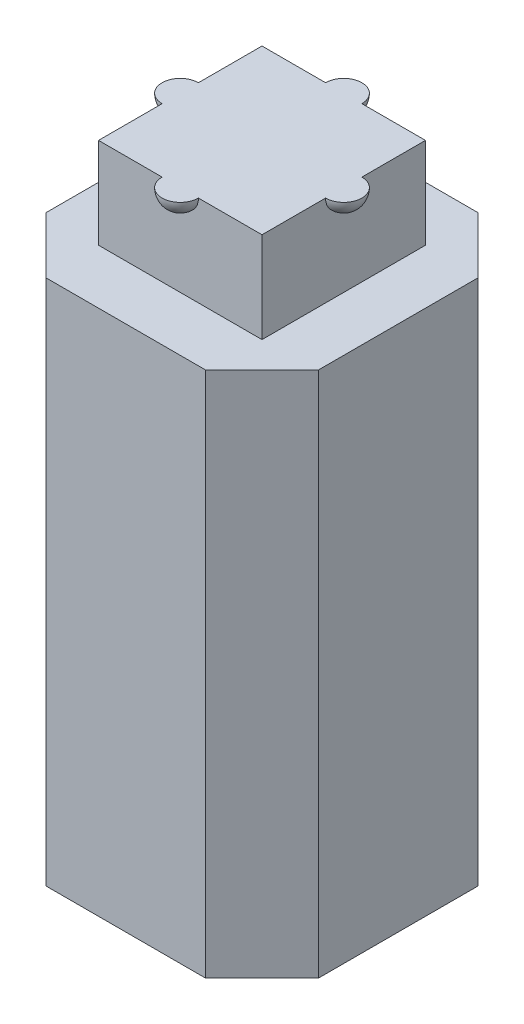
ISO-10303-21;
HEADER;
FILE_DESCRIPTION(('STEP AP214'),'2;1');
FILE_NAME('part.step','',(''),(''),'','','');
FILE_SCHEMA(('AUTOMOTIVE_DESIGN { 1 0 10303 214 1 1 1 1 }'));
ENDSEC;
DATA;
#1=APPLICATION_CONTEXT('core data for automotive mechanical design processes');
#2=APPLICATION_PROTOCOL_DEFINITION('international standard','automotive_design',2000,#1);
#3=PRODUCT_CONTEXT('',#1,'mechanical');
#4=PRODUCT('Part','Part','',(#3));
#5=PRODUCT_RELATED_PRODUCT_CATEGORY('part','',(#4));
#6=PRODUCT_DEFINITION_FORMATION('','',#4);
#7=PRODUCT_DEFINITION_CONTEXT('part definition',#1,'design');
#8=PRODUCT_DEFINITION('design','',#6,#7);
#9=PRODUCT_DEFINITION_SHAPE('','',#8);
#10=(LENGTH_UNIT() NAMED_UNIT(*) SI_UNIT(.MILLI.,.METRE.));
#11=(NAMED_UNIT(*) PLANE_ANGLE_UNIT() SI_UNIT($,.RADIAN.));
#12=(NAMED_UNIT(*) SI_UNIT($,.STERADIAN.) SOLID_ANGLE_UNIT());
#13=UNCERTAINTY_MEASURE_WITH_UNIT(LENGTH_MEASURE(1.E-05),#10,'distance_accuracy_value','');
#14=(GEOMETRIC_REPRESENTATION_CONTEXT(3) GLOBAL_UNCERTAINTY_ASSIGNED_CONTEXT((#13)) GLOBAL_UNIT_ASSIGNED_CONTEXT((#10,
#11,#12)) REPRESENTATION_CONTEXT('',''));
#15=CARTESIAN_POINT('',(0.,0.,0.));
#16=DIRECTION('',(0.,0.,1.));
#17=DIRECTION('',(1.,0.,0.));
#18=AXIS2_PLACEMENT_3D('',#15,#16,#17);
#19=CARTESIAN_POINT('',(0.,17.,2.25));
#20=DIRECTION('',(0.,0.,-1.));
#21=DIRECTION('',(1.,0.,0.));
#22=AXIS2_PLACEMENT_3D('',#19,#20,#21);
#23=SPHERICAL_SURFACE('',#22,0.5);
#24=CARTESIAN_POINT('',(0.,17.,2.25));
#25=DIRECTION('',(0.,0.,-1.));
#26=DIRECTION('',(-1.,0.,0.));
#27=AXIS2_PLACEMENT_3D('',#24,#25,#26);
#28=CIRCLE('',#27,0.5);
#29=CARTESIAN_POINT('',(0.5,17.,2.25));
#30=VERTEX_POINT('',#29);
#31=CARTESIAN_POINT('',(-0.5,17.,2.25));
#32=VERTEX_POINT('',#31);
#33=EDGE_CURVE('E242',#30,#32,#28,.T.);
#34=ORIENTED_EDGE('',*,*,#33,.F.);
#35=CARTESIAN_POINT('',(0.,17.,2.25));
#36=DIRECTION('',(0.,1.,0.));
#37=DIRECTION('',(0.,0.,1.));
#38=AXIS2_PLACEMENT_3D('',#35,#36,#37);
#39=CIRCLE('',#38,0.5);
#40=EDGE_CURVE('E236',#30,#32,#39,.F.);
#41=ORIENTED_EDGE('',*,*,#40,.T.);
#42=EDGE_LOOP('',(#34,#41));
#43=FACE_BOUND('',#42,.T.);
#44=ADVANCED_FACE('F34',(#43),#23,.T.);
#45=CARTESIAN_POINT('',(0.,17.,-2.25));
#46=DIRECTION('',(0.,0.,-1.));
#47=DIRECTION('',(1.,0.,0.));
#48=AXIS2_PLACEMENT_3D('',#45,#46,#47);
#49=SPHERICAL_SURFACE('',#48,0.5);
#50=CARTESIAN_POINT('',(0.,17.,-2.25));
#51=DIRECTION('',(0.,0.,1.));
#52=DIRECTION('',(1.,0.,0.));
#53=AXIS2_PLACEMENT_3D('',#50,#51,#52);
#54=CIRCLE('',#53,0.5);
#55=CARTESIAN_POINT('',(-0.5,17.,-2.25));
#56=VERTEX_POINT('',#55);
#57=CARTESIAN_POINT('',(0.5,17.,-2.25));
#58=VERTEX_POINT('',#57);
#59=EDGE_CURVE('E234',#56,#58,#54,.T.);
#60=ORIENTED_EDGE('',*,*,#59,.F.);
#61=CARTESIAN_POINT('',(0.,17.,-2.25));
#62=DIRECTION('',(0.,1.,0.));
#63=DIRECTION('',(0.,0.,1.));
#64=AXIS2_PLACEMENT_3D('',#61,#62,#63);
#65=CIRCLE('',#64,0.5);
#66=EDGE_CURVE('E54',#56,#58,#65,.F.);
#67=ORIENTED_EDGE('',*,*,#66,.T.);
#68=EDGE_LOOP('',(#60,#67));
#69=FACE_BOUND('',#68,.T.);
#70=ADVANCED_FACE('F482',(#69),#49,.T.);
#71=CARTESIAN_POINT('',(2.25,17.,0.));
#72=DIRECTION('',(-1.,0.,0.));
#73=DIRECTION('',(0.,0.,1.));
#74=AXIS2_PLACEMENT_3D('',#71,#72,#73);
#75=SPHERICAL_SURFACE('',#74,0.5);
#76=CARTESIAN_POINT('',(2.25,17.,0.));
#77=DIRECTION('',(-1.,0.,0.));
#78=DIRECTION('',(0.,0.,1.));
#79=AXIS2_PLACEMENT_3D('',#76,#77,#78);
#80=CIRCLE('',#79,0.5);
#81=CARTESIAN_POINT('',(2.25,17.,-0.5));
#82=VERTEX_POINT('',#81);
#83=CARTESIAN_POINT('',(2.25,17.,0.5));
#84=VERTEX_POINT('',#83);
#85=EDGE_CURVE('E230',#82,#84,#80,.T.);
#86=ORIENTED_EDGE('',*,*,#85,.F.);
#87=CARTESIAN_POINT('',(2.25,17.,0.));
#88=DIRECTION('',(0.,1.,0.));
#89=DIRECTION('',(0.,0.,1.));
#90=AXIS2_PLACEMENT_3D('',#87,#88,#89);
#91=CIRCLE('',#90,0.5);
#92=EDGE_CURVE('E231',#82,#84,#91,.F.);
#93=ORIENTED_EDGE('',*,*,#92,.T.);
#94=EDGE_LOOP('',(#86,#93));
#95=FACE_BOUND('',#94,.T.);
#96=ADVANCED_FACE('F488',(#95),#75,.T.);
#97=CARTESIAN_POINT('',(-2.25,17.,0.));
#98=DIRECTION('',(-1.,0.,0.));
#99=DIRECTION('',(0.,0.,1.));
#100=AXIS2_PLACEMENT_3D('',#97,#98,#99);
#101=SPHERICAL_SURFACE('',#100,0.5);
#102=CARTESIAN_POINT('',(-2.25,17.,0.));
#103=DIRECTION('',(1.,0.,0.));
#104=DIRECTION('',(0.,0.,-1.));
#105=AXIS2_PLACEMENT_3D('',#102,#103,#104);
#106=CIRCLE('',#105,0.5);
#107=CARTESIAN_POINT('',(-2.25,17.,0.5));
#108=VERTEX_POINT('',#107);
#109=CARTESIAN_POINT('',(-2.25,17.,-0.5));
#110=VERTEX_POINT('',#109);
#111=EDGE_CURVE('E217',#108,#110,#106,.T.);
#112=ORIENTED_EDGE('',*,*,#111,.F.);
#113=CARTESIAN_POINT('',(-2.25,17.,0.));
#114=DIRECTION('',(0.,1.,0.));
#115=DIRECTION('',(0.,0.,1.));
#116=AXIS2_PLACEMENT_3D('',#113,#114,#115);
#117=CIRCLE('',#116,0.5);
#118=EDGE_CURVE('E11',#108,#110,#117,.F.);
#119=ORIENTED_EDGE('',*,*,#118,.T.);
#120=EDGE_LOOP('',(#112,#119));
#121=FACE_BOUND('',#120,.T.);
#122=ADVANCED_FACE('F215',(#121),#101,.T.);
#123=CARTESIAN_POINT('',(0.,14.5,0.));
#124=DIRECTION('',(0.,1.,0.));
#125=DIRECTION('',(0.,0.,1.));
#126=AXIS2_PLACEMENT_3D('',#123,#124,#125);
#127=PLANE('',#126);
#128=DIRECTION('',(0.707106781186547,0.,0.707106781186547));
#129=VECTOR('',#128,1.);
#130=CARTESIAN_POINT('',(-3.75,14.5,2.18969696196701));
#131=LINE('',#130,#129);
#132=CARTESIAN_POINT('',(-3.75,14.5,2.18969696196701));
#133=VERTEX_POINT('',#132);
#134=CARTESIAN_POINT('',(-2.18969696196701,14.5,3.75));
#135=VERTEX_POINT('',#134);
#136=EDGE_CURVE('E273',#133,#135,#131,.T.);
#137=ORIENTED_EDGE('',*,*,#136,.T.);
#138=DIRECTION('',(1.,0.,0.));
#139=VECTOR('',#138,1.);
#140=CARTESIAN_POINT('',(-2.18969696196701,14.5,3.75));
#141=LINE('',#140,#139);
#142=CARTESIAN_POINT('',(2.189696961967,14.5,3.75));
#143=VERTEX_POINT('',#142);
#144=EDGE_CURVE('E276',#135,#143,#141,.T.);
#145=ORIENTED_EDGE('',*,*,#144,.T.);
#146=DIRECTION('',(0.707106781186548,0.,-0.707106781186547));
#147=VECTOR('',#146,1.);
#148=CARTESIAN_POINT('',(2.189696961967,14.5,3.75));
#149=LINE('',#148,#147);
#150=CARTESIAN_POINT('',(3.75,14.5,2.189696961967));
#151=VERTEX_POINT('',#150);
#152=EDGE_CURVE('E279',#143,#151,#149,.T.);
#153=ORIENTED_EDGE('',*,*,#152,.T.);
#154=DIRECTION('',(0.,0.,-1.));
#155=VECTOR('',#154,1.);
#156=CARTESIAN_POINT('',(3.75,14.5,2.189696961967));
#157=LINE('',#156,#155);
#158=CARTESIAN_POINT('',(3.75,14.5,-2.18969696196701));
#159=VERTEX_POINT('',#158);
#160=EDGE_CURVE('E282',#151,#159,#157,.T.);
#161=ORIENTED_EDGE('',*,*,#160,.T.);
#162=DIRECTION('',(-0.707106781186552,0.,-0.707106781186544));
#163=VECTOR('',#162,1.);
#164=CARTESIAN_POINT('',(3.75,14.5,-2.18969696196701));
#165=LINE('',#164,#163);
#166=CARTESIAN_POINT('',(2.18969696196699,14.5,-3.75));
#167=VERTEX_POINT('',#166);
#168=EDGE_CURVE('E285',#159,#167,#165,.T.);
#169=ORIENTED_EDGE('',*,*,#168,.T.);
#170=DIRECTION('',(-1.,0.,0.));
#171=VECTOR('',#170,1.);
#172=CARTESIAN_POINT('',(2.18969696196699,14.5,-3.75));
#173=LINE('',#172,#171);
#174=CARTESIAN_POINT('',(-2.189696961967,14.5,-3.75));
#175=VERTEX_POINT('',#174);
#176=EDGE_CURVE('E288',#167,#175,#173,.T.);
#177=ORIENTED_EDGE('',*,*,#176,.T.);
#178=DIRECTION('',(-0.707106781186547,0.,0.707106781186547));
#179=VECTOR('',#178,1.);
#180=CARTESIAN_POINT('',(-2.189696961967,14.5,-3.75));
#181=LINE('',#180,#179);
#182=CARTESIAN_POINT('',(-3.75,14.5,-2.189696961967));
#183=VERTEX_POINT('',#182);
#184=EDGE_CURVE('E291',#175,#183,#181,.T.);
#185=ORIENTED_EDGE('',*,*,#184,.T.);
#186=DIRECTION('',(0.,0.,1.));
#187=VECTOR('',#186,1.);
#188=CARTESIAN_POINT('',(-3.75,14.5,-2.189696961967));
#189=LINE('',#188,#187);
#190=EDGE_CURVE('E294',#183,#133,#189,.T.);
#191=ORIENTED_EDGE('',*,*,#190,.T.);
#192=EDGE_LOOP('',(#137,#145,#153,#161,#169,#177,#185,#191));
#193=FACE_BOUND('',#192,.T.);
#194=DIRECTION('',(-1.,0.,0.));
#195=VECTOR('',#194,1.);
#196=CARTESIAN_POINT('',(-2.25,14.5,-2.25));
#197=LINE('',#196,#195);
#198=CARTESIAN_POINT('',(2.25,14.5,-2.25));
#199=VERTEX_POINT('',#198);
#200=CARTESIAN_POINT('',(-2.25,14.5,-2.25));
#201=VERTEX_POINT('',#200);
#202=EDGE_CURVE('E258',#199,#201,#197,.T.);
#203=ORIENTED_EDGE('',*,*,#202,.F.);
#204=DIRECTION('',(0.,0.,-1.));
#205=VECTOR('',#204,1.);
#206=CARTESIAN_POINT('',(2.25,14.5,-2.25));
#207=LINE('',#206,#205);
#208=CARTESIAN_POINT('',(2.25,14.5,2.25));
#209=VERTEX_POINT('',#208);
#210=EDGE_CURVE('E245',#209,#199,#207,.T.);
#211=ORIENTED_EDGE('',*,*,#210,.F.);
#212=DIRECTION('',(1.,0.,0.));
#213=VECTOR('',#212,1.);
#214=CARTESIAN_POINT('',(-2.25,14.5,2.25));
#215=LINE('',#214,#213);
#216=CARTESIAN_POINT('',(-2.25,14.5,2.25));
#217=VERTEX_POINT('',#216);
#218=EDGE_CURVE('E263',#217,#209,#215,.T.);
#219=ORIENTED_EDGE('',*,*,#218,.F.);
#220=DIRECTION('',(0.,0.,1.));
#221=VECTOR('',#220,1.);
#222=CARTESIAN_POINT('',(-2.25,14.5,-2.25));
#223=LINE('',#222,#221);
#224=EDGE_CURVE('E260',#201,#217,#223,.T.);
#225=ORIENTED_EDGE('',*,*,#224,.F.);
#226=EDGE_LOOP('',(#203,#211,#219,#225));
#227=FACE_BOUND('',#226,.T.);
#228=ADVANCED_FACE('F455',(#193,#227),#127,.T.);
#229=CARTESIAN_POINT('',(0.,0.,0.));
#230=DIRECTION('',(0.,1.,0.));
#231=DIRECTION('',(0.,0.,1.));
#232=AXIS2_PLACEMENT_3D('',#229,#230,#231);
#233=PLANE('',#232);
#234=DIRECTION('',(1.,0.,0.));
#235=VECTOR('',#234,1.);
#236=CARTESIAN_POINT('',(2.189696961967,0.,3.75));
#237=LINE('',#236,#235);
#238=CARTESIAN_POINT('',(-2.18969696196701,0.,3.75));
#239=VERTEX_POINT('',#238);
#240=CARTESIAN_POINT('',(2.189696961967,0.,3.75));
#241=VERTEX_POINT('',#240);
#242=EDGE_CURVE('E395',#239,#241,#237,.T.);
#243=ORIENTED_EDGE('',*,*,#242,.F.);
#244=DIRECTION('',(0.707106781186547,0.,0.707106781186547));
#245=VECTOR('',#244,1.);
#246=CARTESIAN_POINT('',(-3.75,0.,2.18969696196701));
#247=LINE('',#246,#245);
#248=CARTESIAN_POINT('',(-3.75,0.,2.18969696196701));
#249=VERTEX_POINT('',#248);
#250=EDGE_CURVE('E410',#249,#239,#247,.T.);
#251=ORIENTED_EDGE('',*,*,#250,.F.);
#252=DIRECTION('',(0.,0.,1.));
#253=VECTOR('',#252,1.);
#254=CARTESIAN_POINT('',(-3.75,0.,-2.189696961967));
#255=LINE('',#254,#253);
#256=CARTESIAN_POINT('',(-3.75,0.,-2.189696961967));
#257=VERTEX_POINT('',#256);
#258=EDGE_CURVE('E408',#257,#249,#255,.T.);
#259=ORIENTED_EDGE('',*,*,#258,.F.);
#260=DIRECTION('',(-0.707106781186547,0.,0.707106781186547));
#261=VECTOR('',#260,1.);
#262=CARTESIAN_POINT('',(-3.75,0.,-2.189696961967));
#263=LINE('',#262,#261);
#264=CARTESIAN_POINT('',(-2.189696961967,0.,-3.75));
#265=VERTEX_POINT('',#264);
#266=EDGE_CURVE('E406',#265,#257,#263,.T.);
#267=ORIENTED_EDGE('',*,*,#266,.F.);
#268=DIRECTION('',(-1.,0.,0.));
#269=VECTOR('',#268,1.);
#270=CARTESIAN_POINT('',(2.18969696196699,0.,-3.75));
#271=LINE('',#270,#269);
#272=CARTESIAN_POINT('',(2.18969696196699,0.,-3.75));
#273=VERTEX_POINT('',#272);
#274=EDGE_CURVE('E404',#273,#265,#271,.T.);
#275=ORIENTED_EDGE('',*,*,#274,.F.);
#276=DIRECTION('',(-0.707106781186552,0.,-0.707106781186544));
#277=VECTOR('',#276,1.);
#278=CARTESIAN_POINT('',(2.18969696196699,0.,-3.75));
#279=LINE('',#278,#277);
#280=CARTESIAN_POINT('',(3.75,0.,-2.18969696196701));
#281=VERTEX_POINT('',#280);
#282=EDGE_CURVE('E402',#281,#273,#279,.T.);
#283=ORIENTED_EDGE('',*,*,#282,.F.);
#284=DIRECTION('',(0.,0.,-1.));
#285=VECTOR('',#284,1.);
#286=CARTESIAN_POINT('',(3.75,0.,-2.18969696196701));
#287=LINE('',#286,#285);
#288=CARTESIAN_POINT('',(3.75,0.,2.189696961967));
#289=VERTEX_POINT('',#288);
#290=EDGE_CURVE('E400',#289,#281,#287,.T.);
#291=ORIENTED_EDGE('',*,*,#290,.F.);
#292=DIRECTION('',(0.707106781186548,0.,-0.707106781186547));
#293=VECTOR('',#292,1.);
#294=CARTESIAN_POINT('',(2.189696961967,0.,3.75));
#295=LINE('',#294,#293);
#296=EDGE_CURVE('E398',#241,#289,#295,.T.);
#297=ORIENTED_EDGE('',*,*,#296,.F.);
#298=EDGE_LOOP('',(#243,#251,#259,#267,#275,#283,#291,#297));
#299=FACE_BOUND('',#298,.T.);
#300=DIRECTION('',(1.,0.,0.));
#301=VECTOR('',#300,1.);
#302=CARTESIAN_POINT('',(0.4,0.,2.25));
#303=LINE('',#302,#301);
#304=CARTESIAN_POINT('',(0.4,0.,2.25));
#305=VERTEX_POINT('',#304);
#306=CARTESIAN_POINT('',(2.25,0.,2.25));
#307=VERTEX_POINT('',#306);
#308=EDGE_CURVE('E297',#305,#307,#303,.T.);
#309=ORIENTED_EDGE('',*,*,#308,.T.);
#310=DIRECTION('',(0.,0.,-1.));
#311=VECTOR('',#310,1.);
#312=CARTESIAN_POINT('',(2.25,0.,0.4));
#313=LINE('',#312,#311);
#314=CARTESIAN_POINT('',(2.25,0.,0.4));
#315=VERTEX_POINT('',#314);
#316=EDGE_CURVE('E338',#307,#315,#313,.T.);
#317=ORIENTED_EDGE('',*,*,#316,.T.);
#318=CARTESIAN_POINT('',(2.25,0.,0.));
#319=DIRECTION('',(0.,1.,0.));
#320=DIRECTION('',(0.,0.,1.));
#321=AXIS2_PLACEMENT_3D('',#318,#319,#320);
#322=CIRCLE('',#321,0.4);
#323=CARTESIAN_POINT('',(2.25,0.,-0.400000000000001));
#324=VERTEX_POINT('',#323);
#325=EDGE_CURVE('E341',#315,#324,#322,.T.);
#326=ORIENTED_EDGE('',*,*,#325,.T.);
#327=DIRECTION('',(0.,0.,-1.));
#328=VECTOR('',#327,1.);
#329=CARTESIAN_POINT('',(2.25,0.,-2.25));
#330=LINE('',#329,#328);
#331=CARTESIAN_POINT('',(2.25,0.,-2.25));
#332=VERTEX_POINT('',#331);
#333=EDGE_CURVE('E344',#324,#332,#330,.T.);
#334=ORIENTED_EDGE('',*,*,#333,.T.);
#335=DIRECTION('',(-1.,0.,0.));
#336=VECTOR('',#335,1.);
#337=CARTESIAN_POINT('',(0.4,0.,-2.25));
#338=LINE('',#337,#336);
#339=CARTESIAN_POINT('',(0.4,0.,-2.25));
#340=VERTEX_POINT('',#339);
#341=EDGE_CURVE('E347',#332,#340,#338,.T.);
#342=ORIENTED_EDGE('',*,*,#341,.T.);
#343=CARTESIAN_POINT('',(0.,0.,-2.25));
#344=DIRECTION('',(0.,1.,0.));
#345=DIRECTION('',(0.,0.,1.));
#346=AXIS2_PLACEMENT_3D('',#343,#344,#345);
#347=CIRCLE('',#346,0.4);
#348=CARTESIAN_POINT('',(-0.400000000000001,0.,-2.25));
#349=VERTEX_POINT('',#348);
#350=EDGE_CURVE('E350',#340,#349,#347,.T.);
#351=ORIENTED_EDGE('',*,*,#350,.T.);
#352=DIRECTION('',(-1.,0.,0.));
#353=VECTOR('',#352,1.);
#354=CARTESIAN_POINT('',(-2.25,0.,-2.25));
#355=LINE('',#354,#353);
#356=CARTESIAN_POINT('',(-2.25,0.,-2.25));
#357=VERTEX_POINT('',#356);
#358=EDGE_CURVE('E353',#349,#357,#355,.T.);
#359=ORIENTED_EDGE('',*,*,#358,.T.);
#360=DIRECTION('',(0.,0.,1.));
#361=VECTOR('',#360,1.);
#362=CARTESIAN_POINT('',(-2.25,0.,-2.25));
#363=LINE('',#362,#361);
#364=CARTESIAN_POINT('',(-2.25,0.,-0.4));
#365=VERTEX_POINT('',#364);
#366=EDGE_CURVE('E356',#357,#365,#363,.T.);
#367=ORIENTED_EDGE('',*,*,#366,.T.);
#368=CARTESIAN_POINT('',(-2.25,0.,0.));
#369=DIRECTION('',(0.,1.,0.));
#370=DIRECTION('',(0.,0.,1.));
#371=AXIS2_PLACEMENT_3D('',#368,#369,#370);
#372=CIRCLE('',#371,0.4);
#373=CARTESIAN_POINT('',(-2.25,0.,0.4));
#374=VERTEX_POINT('',#373);
#375=EDGE_CURVE('E359',#365,#374,#372,.T.);
#376=ORIENTED_EDGE('',*,*,#375,.T.);
#377=DIRECTION('',(0.,0.,1.));
#378=VECTOR('',#377,1.);
#379=CARTESIAN_POINT('',(-2.25,0.,0.4));
#380=LINE('',#379,#378);
#381=CARTESIAN_POINT('',(-2.25,0.,2.25));
#382=VERTEX_POINT('',#381);
#383=EDGE_CURVE('E362',#374,#382,#380,.T.);
#384=ORIENTED_EDGE('',*,*,#383,.T.);
#385=DIRECTION('',(1.,0.,0.));
#386=VECTOR('',#385,1.);
#387=CARTESIAN_POINT('',(-2.25,0.,2.25));
#388=LINE('',#387,#386);
#389=CARTESIAN_POINT('',(-0.400000000000001,0.,2.25));
#390=VERTEX_POINT('',#389);
#391=EDGE_CURVE('E365',#382,#390,#388,.T.);
#392=ORIENTED_EDGE('',*,*,#391,.T.);
#393=CARTESIAN_POINT('',(0.,0.,2.25));
#394=DIRECTION('',(0.,1.,0.));
#395=DIRECTION('',(0.,0.,1.));
#396=AXIS2_PLACEMENT_3D('',#393,#394,#395);
#397=CIRCLE('',#396,0.4);
#398=EDGE_CURVE('E302',#390,#305,#397,.T.);
#399=ORIENTED_EDGE('',*,*,#398,.T.);
#400=EDGE_LOOP('',(#309,#317,#326,#334,#342,#351,#359,#367,#376,#384,#392,#399));
#401=FACE_BOUND('',#400,.T.);
#402=ADVANCED_FACE('F441',(#299,#401),#233,.F.);
#403=CARTESIAN_POINT('',(2.189696961967,4.,3.75));
#404=DIRECTION('',(0.,0.,-1.));
#405=DIRECTION('',(-1.,0.,0.));
#406=AXIS2_PLACEMENT_3D('',#403,#404,#405);
#407=PLANE('',#406);
#408=ORIENTED_EDGE('',*,*,#242,.T.);
#409=DIRECTION('',(0.,-1.,0.));
#410=VECTOR('',#409,1.);
#411=CARTESIAN_POINT('',(2.189696961967,4.,3.75));
#412=LINE('',#411,#410);
#413=EDGE_CURVE('E42',#143,#241,#412,.T.);
#414=ORIENTED_EDGE('',*,*,#413,.F.);
#415=ORIENTED_EDGE('',*,*,#144,.F.);
#416=DIRECTION('',(0.,-1.,0.));
#417=VECTOR('',#416,1.);
#418=CARTESIAN_POINT('',(-2.18969696196701,4.,3.75));
#419=LINE('',#418,#417);
#420=EDGE_CURVE('E412',#135,#239,#419,.T.);
#421=ORIENTED_EDGE('',*,*,#420,.T.);
#422=EDGE_LOOP('',(#408,#414,#415,#421));
#423=FACE_BOUND('',#422,.T.);
#424=ADVANCED_FACE('F36',(#423),#407,.F.);
#425=CARTESIAN_POINT('',(2.189696961967,4.,3.75));
#426=DIRECTION('',(-0.707106781186547,0.,-0.707106781186548));
#427=DIRECTION('',(-0.707106781186548,0.,0.707106781186547));
#428=AXIS2_PLACEMENT_3D('',#425,#426,#427);
#429=PLANE('',#428);
#430=ORIENTED_EDGE('',*,*,#296,.T.);
#431=DIRECTION('',(0.,-1.,0.));
#432=VECTOR('',#431,1.);
#433=CARTESIAN_POINT('',(3.75,4.,2.189696961967));
#434=LINE('',#433,#432);
#435=EDGE_CURVE('E430',#151,#289,#434,.T.);
#436=ORIENTED_EDGE('',*,*,#435,.F.);
#437=ORIENTED_EDGE('',*,*,#152,.F.);
#438=ORIENTED_EDGE('',*,*,#413,.T.);
#439=EDGE_LOOP('',(#430,#436,#437,#438));
#440=FACE_BOUND('',#439,.T.);
#441=ADVANCED_FACE('F435',(#440),#429,.F.);
#442=CARTESIAN_POINT('',(3.75,4.,-2.18969696196701));
#443=DIRECTION('',(-1.,0.,0.));
#444=DIRECTION('',(0.,0.,1.));
#445=AXIS2_PLACEMENT_3D('',#442,#443,#444);
#446=PLANE('',#445);
#447=ORIENTED_EDGE('',*,*,#290,.T.);
#448=DIRECTION('',(0.,-1.,0.));
#449=VECTOR('',#448,1.);
#450=CARTESIAN_POINT('',(3.75,4.,-2.18969696196701));
#451=LINE('',#450,#449);
#452=EDGE_CURVE('E427',#159,#281,#451,.T.);
#453=ORIENTED_EDGE('',*,*,#452,.F.);
#454=ORIENTED_EDGE('',*,*,#160,.F.);
#455=ORIENTED_EDGE('',*,*,#435,.T.);
#456=EDGE_LOOP('',(#447,#453,#454,#455));
#457=FACE_BOUND('',#456,.T.);
#458=ADVANCED_FACE('F448',(#457),#446,.F.);
#459=CARTESIAN_POINT('',(2.18969696196699,4.,-3.75));
#460=DIRECTION('',(-0.707106781186543,0.,0.707106781186552));
#461=DIRECTION('',(0.707106781186552,0.,0.707106781186543));
#462=AXIS2_PLACEMENT_3D('',#459,#460,#461);
#463=PLANE('',#462);
#464=ORIENTED_EDGE('',*,*,#282,.T.);
#465=DIRECTION('',(0.,-1.,0.));
#466=VECTOR('',#465,1.);
#467=CARTESIAN_POINT('',(2.18969696196699,4.,-3.75));
#468=LINE('',#467,#466);
#469=EDGE_CURVE('E424',#167,#273,#468,.T.);
#470=ORIENTED_EDGE('',*,*,#469,.F.);
#471=ORIENTED_EDGE('',*,*,#168,.F.);
#472=ORIENTED_EDGE('',*,*,#452,.T.);
#473=EDGE_LOOP('',(#464,#470,#471,#472));
#474=FACE_BOUND('',#473,.T.);
#475=ADVANCED_FACE('F452',(#474),#463,.F.);
#476=CARTESIAN_POINT('',(2.18969696196699,4.,-3.75));
#477=DIRECTION('',(0.,0.,1.));
#478=DIRECTION('',(1.,0.,0.));
#479=AXIS2_PLACEMENT_3D('',#476,#477,#478);
#480=PLANE('',#479);
#481=ORIENTED_EDGE('',*,*,#274,.T.);
#482=DIRECTION('',(0.,-1.,0.));
#483=VECTOR('',#482,1.);
#484=CARTESIAN_POINT('',(-2.189696961967,4.,-3.75));
#485=LINE('',#484,#483);
#486=EDGE_CURVE('E421',#175,#265,#485,.T.);
#487=ORIENTED_EDGE('',*,*,#486,.F.);
#488=ORIENTED_EDGE('',*,*,#176,.F.);
#489=ORIENTED_EDGE('',*,*,#469,.T.);
#490=EDGE_LOOP('',(#481,#487,#488,#489));
#491=FACE_BOUND('',#490,.T.);
#492=ADVANCED_FACE('F459',(#491),#480,.F.);
#493=CARTESIAN_POINT('',(-3.75,4.,-2.189696961967));
#494=DIRECTION('',(0.707106781186547,0.,0.707106781186547));
#495=DIRECTION('',(0.707106781186548,0.,-0.707106781186548));
#496=AXIS2_PLACEMENT_3D('',#493,#494,#495);
#497=PLANE('',#496);
#498=ORIENTED_EDGE('',*,*,#266,.T.);
#499=DIRECTION('',(0.,-1.,0.));
#500=VECTOR('',#499,1.);
#501=CARTESIAN_POINT('',(-3.75,4.,-2.189696961967));
#502=LINE('',#501,#500);
#503=EDGE_CURVE('E418',#183,#257,#502,.T.);
#504=ORIENTED_EDGE('',*,*,#503,.F.);
#505=ORIENTED_EDGE('',*,*,#184,.F.);
#506=ORIENTED_EDGE('',*,*,#486,.T.);
#507=EDGE_LOOP('',(#498,#504,#505,#506));
#508=FACE_BOUND('',#507,.T.);
#509=ADVANCED_FACE('F462',(#508),#497,.F.);
#510=CARTESIAN_POINT('',(-3.75,4.,-2.189696961967));
#511=DIRECTION('',(1.,0.,0.));
#512=DIRECTION('',(0.,0.,-1.));
#513=AXIS2_PLACEMENT_3D('',#510,#511,#512);
#514=PLANE('',#513);
#515=ORIENTED_EDGE('',*,*,#258,.T.);
#516=DIRECTION('',(0.,-1.,0.));
#517=VECTOR('',#516,1.);
#518=CARTESIAN_POINT('',(-3.75,4.,2.18969696196701));
#519=LINE('',#518,#517);
#520=EDGE_CURVE('E415',#133,#249,#519,.T.);
#521=ORIENTED_EDGE('',*,*,#520,.F.);
#522=ORIENTED_EDGE('',*,*,#190,.F.);
#523=ORIENTED_EDGE('',*,*,#503,.T.);
#524=EDGE_LOOP('',(#515,#521,#522,#523));
#525=FACE_BOUND('',#524,.T.);
#526=ADVANCED_FACE('F464',(#525),#514,.F.);
#527=CARTESIAN_POINT('',(-3.75,4.,2.18969696196701));
#528=DIRECTION('',(0.707106781186547,0.,-0.707106781186547));
#529=DIRECTION('',(-0.707106781186548,0.,-0.707106781186548));
#530=AXIS2_PLACEMENT_3D('',#527,#528,#529);
#531=PLANE('',#530);
#532=ORIENTED_EDGE('',*,*,#250,.T.);
#533=ORIENTED_EDGE('',*,*,#420,.F.);
#534=ORIENTED_EDGE('',*,*,#136,.F.);
#535=ORIENTED_EDGE('',*,*,#520,.T.);
#536=EDGE_LOOP('',(#532,#533,#534,#535));
#537=FACE_BOUND('',#536,.T.);
#538=ADVANCED_FACE('F468',(#537),#531,.F.);
#539=CARTESIAN_POINT('',(0.4,4.,2.25));
#540=DIRECTION('',(0.,0.,-1.));
#541=DIRECTION('',(-1.,0.,0.));
#542=AXIS2_PLACEMENT_3D('',#539,#540,#541);
#543=PLANE('',#542);
#544=ORIENTED_EDGE('',*,*,#308,.F.);
#545=DIRECTION('',(0.,-1.,0.));
#546=VECTOR('',#545,1.);
#547=CARTESIAN_POINT('',(0.4,4.,2.25));
#548=LINE('',#547,#546);
#549=CARTESIAN_POINT('',(0.4,4.,2.25));
#550=VERTEX_POINT('',#549);
#551=EDGE_CURVE('E335',#550,#305,#548,.T.);
#552=ORIENTED_EDGE('',*,*,#551,.F.);
#553=DIRECTION('',(1.,0.,0.));
#554=VECTOR('',#553,1.);
#555=CARTESIAN_POINT('',(0.4,4.,2.25));
#556=LINE('',#555,#554);
#557=CARTESIAN_POINT('',(2.25,4.,2.25));
#558=VERTEX_POINT('',#557);
#559=EDGE_CURVE('E298',#550,#558,#556,.T.);
#560=ORIENTED_EDGE('',*,*,#559,.T.);
#561=DIRECTION('',(0.,-1.,0.));
#562=VECTOR('',#561,1.);
#563=CARTESIAN_POINT('',(2.25,4.,2.25));
#564=LINE('',#563,#562);
#565=EDGE_CURVE('E392',#558,#307,#564,.T.);
#566=ORIENTED_EDGE('',*,*,#565,.T.);
#567=EDGE_LOOP('',(#544,#552,#560,#566));
#568=FACE_BOUND('',#567,.T.);
#569=ADVANCED_FACE('F470',(#568),#543,.T.);
#570=CARTESIAN_POINT('',(2.25,4.,0.4));
#571=DIRECTION('',(-1.,0.,0.));
#572=DIRECTION('',(0.,0.,1.));
#573=AXIS2_PLACEMENT_3D('',#570,#571,#572);
#574=PLANE('',#573);
#575=ORIENTED_EDGE('',*,*,#316,.F.);
#576=ORIENTED_EDGE('',*,*,#565,.F.);
#577=DIRECTION('',(0.,0.,-1.));
#578=VECTOR('',#577,1.);
#579=CARTESIAN_POINT('',(2.25,4.,0.4));
#580=LINE('',#579,#578);
#581=CARTESIAN_POINT('',(2.25,4.,0.4));
#582=VERTEX_POINT('',#581);
#583=EDGE_CURVE('E301',#558,#582,#580,.T.);
#584=ORIENTED_EDGE('',*,*,#583,.T.);
#585=DIRECTION('',(0.,-1.,0.));
#586=VECTOR('',#585,1.);
#587=CARTESIAN_POINT('',(2.25,4.,0.4));
#588=LINE('',#587,#586);
#589=EDGE_CURVE('E390',#582,#315,#588,.T.);
#590=ORIENTED_EDGE('',*,*,#589,.T.);
#591=EDGE_LOOP('',(#575,#576,#584,#590));
#592=FACE_BOUND('',#591,.T.);
#593=ADVANCED_FACE('F476',(#592),#574,.T.);
#594=CARTESIAN_POINT('',(2.25,4.,0.));
#595=DIRECTION('',(0.,-1.,0.));
#596=DIRECTION('',(0.,0.,-1.));
#597=AXIS2_PLACEMENT_3D('',#594,#595,#596);
#598=CYLINDRICAL_SURFACE('',#597,0.4);
#599=ORIENTED_EDGE('',*,*,#325,.F.);
#600=ORIENTED_EDGE('',*,*,#589,.F.);
#601=CARTESIAN_POINT('',(2.25,4.,0.));
#602=DIRECTION('',(0.,1.,0.));
#603=DIRECTION('',(0.,0.,1.));
#604=AXIS2_PLACEMENT_3D('',#601,#602,#603);
#605=CIRCLE('',#604,0.4);
#606=CARTESIAN_POINT('',(2.25,4.,-0.400000000000001));
#607=VERTEX_POINT('',#606);
#608=EDGE_CURVE('E305',#582,#607,#605,.T.);
#609=ORIENTED_EDGE('',*,*,#608,.T.);
#610=DIRECTION('',(0.,-1.,0.));
#611=VECTOR('',#610,1.);
#612=CARTESIAN_POINT('',(2.25,4.,-0.400000000000001));
#613=LINE('',#612,#611);
#614=EDGE_CURVE('E388',#607,#324,#613,.T.);
#615=ORIENTED_EDGE('',*,*,#614,.T.);
#616=EDGE_LOOP('',(#599,#600,#609,#615));
#617=FACE_BOUND('',#616,.T.);
#618=ADVANCED_FACE('F551',(#617),#598,.F.);
#619=CARTESIAN_POINT('',(2.25,4.,-2.25));
#620=DIRECTION('',(-1.,0.,0.));
#621=DIRECTION('',(0.,0.,1.));
#622=AXIS2_PLACEMENT_3D('',#619,#620,#621);
#623=PLANE('',#622);
#624=ORIENTED_EDGE('',*,*,#333,.F.);
#625=ORIENTED_EDGE('',*,*,#614,.F.);
#626=DIRECTION('',(0.,0.,-1.));
#627=VECTOR('',#626,1.);
#628=CARTESIAN_POINT('',(2.25,4.,-2.25));
#629=LINE('',#628,#627);
#630=CARTESIAN_POINT('',(2.25,4.,-2.25));
#631=VERTEX_POINT('',#630);
#632=EDGE_CURVE('E308',#607,#631,#629,.T.);
#633=ORIENTED_EDGE('',*,*,#632,.T.);
#634=DIRECTION('',(0.,-1.,0.));
#635=VECTOR('',#634,1.);
#636=CARTESIAN_POINT('',(2.25,4.,-2.25));
#637=LINE('',#636,#635);
#638=EDGE_CURVE('E386',#631,#332,#637,.T.);
#639=ORIENTED_EDGE('',*,*,#638,.T.);
#640=EDGE_LOOP('',(#624,#625,#633,#639));
#641=FACE_BOUND('',#640,.T.);
#642=ADVANCED_FACE('F547',(#641),#623,.T.);
#643=CARTESIAN_POINT('',(0.4,4.,-2.25));
#644=DIRECTION('',(0.,0.,1.));
#645=DIRECTION('',(1.,0.,0.));
#646=AXIS2_PLACEMENT_3D('',#643,#644,#645);
#647=PLANE('',#646);
#648=ORIENTED_EDGE('',*,*,#341,.F.);
#649=ORIENTED_EDGE('',*,*,#638,.F.);
#650=DIRECTION('',(-1.,0.,0.));
#651=VECTOR('',#650,1.);
#652=CARTESIAN_POINT('',(0.4,4.,-2.25));
#653=LINE('',#652,#651);
#654=CARTESIAN_POINT('',(0.4,4.,-2.25));
#655=VERTEX_POINT('',#654);
#656=EDGE_CURVE('E311',#631,#655,#653,.T.);
#657=ORIENTED_EDGE('',*,*,#656,.T.);
#658=DIRECTION('',(0.,-1.,0.));
#659=VECTOR('',#658,1.);
#660=CARTESIAN_POINT('',(0.4,4.,-2.25));
#661=LINE('',#660,#659);
#662=EDGE_CURVE('E384',#655,#340,#661,.T.);
#663=ORIENTED_EDGE('',*,*,#662,.T.);
#664=EDGE_LOOP('',(#648,#649,#657,#663));
#665=FACE_BOUND('',#664,.T.);
#666=ADVANCED_FACE('F543',(#665),#647,.T.);
#667=CARTESIAN_POINT('',(0.,4.,-2.25));
#668=DIRECTION('',(0.,-1.,0.));
#669=DIRECTION('',(0.,0.,-1.));
#670=AXIS2_PLACEMENT_3D('',#667,#668,#669);
#671=CYLINDRICAL_SURFACE('',#670,0.4);
#672=ORIENTED_EDGE('',*,*,#350,.F.);
#673=ORIENTED_EDGE('',*,*,#662,.F.);
#674=CARTESIAN_POINT('',(0.,4.,-2.25));
#675=DIRECTION('',(0.,1.,0.));
#676=DIRECTION('',(0.,0.,1.));
#677=AXIS2_PLACEMENT_3D('',#674,#675,#676);
#678=CIRCLE('',#677,0.4);
#679=CARTESIAN_POINT('',(-0.4,4.,-2.25));
#680=VERTEX_POINT('',#679);
#681=EDGE_CURVE('E314',#655,#680,#678,.T.);
#682=ORIENTED_EDGE('',*,*,#681,.T.);
#683=DIRECTION('',(0.,-1.,0.));
#684=VECTOR('',#683,1.);
#685=CARTESIAN_POINT('',(-0.400000000000001,4.,-2.25));
#686=LINE('',#685,#684);
#687=EDGE_CURVE('E382',#680,#349,#686,.T.);
#688=ORIENTED_EDGE('',*,*,#687,.T.);
#689=EDGE_LOOP('',(#672,#673,#682,#688));
#690=FACE_BOUND('',#689,.T.);
#691=ADVANCED_FACE('F539',(#690),#671,.F.);
#692=CARTESIAN_POINT('',(-2.25,4.,-2.25));
#693=DIRECTION('',(0.,0.,1.));
#694=DIRECTION('',(1.,0.,0.));
#695=AXIS2_PLACEMENT_3D('',#692,#693,#694);
#696=PLANE('',#695);
#697=ORIENTED_EDGE('',*,*,#358,.F.);
#698=ORIENTED_EDGE('',*,*,#687,.F.);
#699=DIRECTION('',(-1.,0.,0.));
#700=VECTOR('',#699,1.);
#701=CARTESIAN_POINT('',(-2.25,4.,-2.25));
#702=LINE('',#701,#700);
#703=CARTESIAN_POINT('',(-2.25,4.,-2.25));
#704=VERTEX_POINT('',#703);
#705=EDGE_CURVE('E317',#680,#704,#702,.T.);
#706=ORIENTED_EDGE('',*,*,#705,.T.);
#707=DIRECTION('',(0.,-1.,0.));
#708=VECTOR('',#707,1.);
#709=CARTESIAN_POINT('',(-2.25,4.,-2.25));
#710=LINE('',#709,#708);
#711=EDGE_CURVE('E380',#704,#357,#710,.T.);
#712=ORIENTED_EDGE('',*,*,#711,.T.);
#713=EDGE_LOOP('',(#697,#698,#706,#712));
#714=FACE_BOUND('',#713,.T.);
#715=ADVANCED_FACE('F535',(#714),#696,.T.);
#716=CARTESIAN_POINT('',(-2.25,4.,-2.25));
#717=DIRECTION('',(1.,0.,0.));
#718=DIRECTION('',(0.,0.,-1.));
#719=AXIS2_PLACEMENT_3D('',#716,#717,#718);
#720=PLANE('',#719);
#721=ORIENTED_EDGE('',*,*,#366,.F.);
#722=ORIENTED_EDGE('',*,*,#711,.F.);
#723=DIRECTION('',(0.,0.,1.));
#724=VECTOR('',#723,1.);
#725=CARTESIAN_POINT('',(-2.25,4.,-2.25));
#726=LINE('',#725,#724);
#727=CARTESIAN_POINT('',(-2.25,4.,-0.4));
#728=VERTEX_POINT('',#727);
#729=EDGE_CURVE('E320',#704,#728,#726,.T.);
#730=ORIENTED_EDGE('',*,*,#729,.T.);
#731=DIRECTION('',(0.,-1.,0.));
#732=VECTOR('',#731,1.);
#733=CARTESIAN_POINT('',(-2.25,4.,-0.4));
#734=LINE('',#733,#732);
#735=EDGE_CURVE('E378',#728,#365,#734,.T.);
#736=ORIENTED_EDGE('',*,*,#735,.T.);
#737=EDGE_LOOP('',(#721,#722,#730,#736));
#738=FACE_BOUND('',#737,.T.);
#739=ADVANCED_FACE('F531',(#738),#720,.T.);
#740=CARTESIAN_POINT('',(-2.25,4.,0.));
#741=DIRECTION('',(0.,-1.,0.));
#742=DIRECTION('',(0.,0.,-1.));
#743=AXIS2_PLACEMENT_3D('',#740,#741,#742);
#744=CYLINDRICAL_SURFACE('',#743,0.4);
#745=ORIENTED_EDGE('',*,*,#375,.F.);
#746=ORIENTED_EDGE('',*,*,#735,.F.);
#747=CARTESIAN_POINT('',(-2.25,4.,0.));
#748=DIRECTION('',(0.,1.,0.));
#749=DIRECTION('',(0.,0.,1.));
#750=AXIS2_PLACEMENT_3D('',#747,#748,#749);
#751=CIRCLE('',#750,0.4);
#752=CARTESIAN_POINT('',(-2.25,4.,0.4));
#753=VERTEX_POINT('',#752);
#754=EDGE_CURVE('E323',#728,#753,#751,.T.);
#755=ORIENTED_EDGE('',*,*,#754,.T.);
#756=DIRECTION('',(0.,-1.,0.));
#757=VECTOR('',#756,1.);
#758=CARTESIAN_POINT('',(-2.25,4.,0.4));
#759=LINE('',#758,#757);
#760=EDGE_CURVE('E376',#753,#374,#759,.T.);
#761=ORIENTED_EDGE('',*,*,#760,.T.);
#762=EDGE_LOOP('',(#745,#746,#755,#761));
#763=FACE_BOUND('',#762,.T.);
#764=ADVANCED_FACE('F527',(#763),#744,.F.);
#765=CARTESIAN_POINT('',(-2.25,4.,0.4));
#766=DIRECTION('',(1.,0.,0.));
#767=DIRECTION('',(0.,0.,-1.));
#768=AXIS2_PLACEMENT_3D('',#765,#766,#767);
#769=PLANE('',#768);
#770=ORIENTED_EDGE('',*,*,#383,.F.);
#771=ORIENTED_EDGE('',*,*,#760,.F.);
#772=DIRECTION('',(0.,0.,1.));
#773=VECTOR('',#772,1.);
#774=CARTESIAN_POINT('',(-2.25,4.,0.4));
#775=LINE('',#774,#773);
#776=CARTESIAN_POINT('',(-2.25,4.,2.25));
#777=VERTEX_POINT('',#776);
#778=EDGE_CURVE('E326',#753,#777,#775,.T.);
#779=ORIENTED_EDGE('',*,*,#778,.T.);
#780=DIRECTION('',(0.,-1.,0.));
#781=VECTOR('',#780,1.);
#782=CARTESIAN_POINT('',(-2.25,4.,2.25));
#783=LINE('',#782,#781);
#784=EDGE_CURVE('E374',#777,#382,#783,.T.);
#785=ORIENTED_EDGE('',*,*,#784,.T.);
#786=EDGE_LOOP('',(#770,#771,#779,#785));
#787=FACE_BOUND('',#786,.T.);
#788=ADVANCED_FACE('F523',(#787),#769,.T.);
#789=CARTESIAN_POINT('',(-2.25,4.,2.25));
#790=DIRECTION('',(0.,0.,-1.));
#791=DIRECTION('',(-1.,0.,0.));
#792=AXIS2_PLACEMENT_3D('',#789,#790,#791);
#793=PLANE('',#792);
#794=ORIENTED_EDGE('',*,*,#391,.F.);
#795=ORIENTED_EDGE('',*,*,#784,.F.);
#796=DIRECTION('',(1.,0.,0.));
#797=VECTOR('',#796,1.);
#798=CARTESIAN_POINT('',(-2.25,4.,2.25));
#799=LINE('',#798,#797);
#800=CARTESIAN_POINT('',(-0.400000000000001,4.,2.25));
#801=VERTEX_POINT('',#800);
#802=EDGE_CURVE('E329',#777,#801,#799,.T.);
#803=ORIENTED_EDGE('',*,*,#802,.T.);
#804=DIRECTION('',(0.,-1.,0.));
#805=VECTOR('',#804,1.);
#806=CARTESIAN_POINT('',(-0.400000000000001,4.,2.25));
#807=LINE('',#806,#805);
#808=EDGE_CURVE('E372',#801,#390,#807,.T.);
#809=ORIENTED_EDGE('',*,*,#808,.T.);
#810=EDGE_LOOP('',(#794,#795,#803,#809));
#811=FACE_BOUND('',#810,.T.);
#812=ADVANCED_FACE('F519',(#811),#793,.T.);
#813=CARTESIAN_POINT('',(0.,4.,2.25));
#814=DIRECTION('',(0.,-1.,0.));
#815=DIRECTION('',(0.,0.,-1.));
#816=AXIS2_PLACEMENT_3D('',#813,#814,#815);
#817=CYLINDRICAL_SURFACE('',#816,0.4);
#818=ORIENTED_EDGE('',*,*,#398,.F.);
#819=ORIENTED_EDGE('',*,*,#808,.F.);
#820=CARTESIAN_POINT('',(0.,4.,2.25));
#821=DIRECTION('',(0.,1.,0.));
#822=DIRECTION('',(0.,0.,1.));
#823=AXIS2_PLACEMENT_3D('',#820,#821,#822);
#824=CIRCLE('',#823,0.4);
#825=EDGE_CURVE('E332',#801,#550,#824,.T.);
#826=ORIENTED_EDGE('',*,*,#825,.T.);
#827=ORIENTED_EDGE('',*,*,#551,.T.);
#828=EDGE_LOOP('',(#818,#819,#826,#827));
#829=FACE_BOUND('',#828,.T.);
#830=ADVANCED_FACE('F515',(#829),#817,.F.);
#831=CARTESIAN_POINT('',(0.,4.,0.));
#832=DIRECTION('',(0.,1.,0.));
#833=DIRECTION('',(0.,0.,1.));
#834=AXIS2_PLACEMENT_3D('',#831,#832,#833);
#835=PLANE('',#834);
#836=ORIENTED_EDGE('',*,*,#559,.F.);
#837=ORIENTED_EDGE('',*,*,#825,.F.);
#838=ORIENTED_EDGE('',*,*,#802,.F.);
#839=ORIENTED_EDGE('',*,*,#778,.F.);
#840=ORIENTED_EDGE('',*,*,#754,.F.);
#841=ORIENTED_EDGE('',*,*,#729,.F.);
#842=ORIENTED_EDGE('',*,*,#705,.F.);
#843=ORIENTED_EDGE('',*,*,#681,.F.);
#844=ORIENTED_EDGE('',*,*,#656,.F.);
#845=ORIENTED_EDGE('',*,*,#632,.F.);
#846=ORIENTED_EDGE('',*,*,#608,.F.);
#847=ORIENTED_EDGE('',*,*,#583,.F.);
#848=EDGE_LOOP('',(#836,#837,#838,#839,#840,#841,#842,#843,#844,#845,#846,#847));
#849=FACE_BOUND('',#848,.T.);
#850=ADVANCED_FACE('F509',(#849),#835,.F.);
#851=CARTESIAN_POINT('',(2.25,17.,-2.25));
#852=DIRECTION('',(-1.,0.,0.));
#853=DIRECTION('',(0.,0.,1.));
#854=AXIS2_PLACEMENT_3D('',#851,#852,#853);
#855=PLANE('',#854);
#856=DIRECTION('',(0.,0.,-1.));
#857=VECTOR('',#856,1.);
#858=CARTESIAN_POINT('',(2.25,17.,-2.25));
#859=LINE('',#858,#857);
#860=CARTESIAN_POINT('',(2.25,17.,-2.25));
#861=VERTEX_POINT('',#860);
#862=EDGE_CURVE('E249',#82,#861,#859,.T.);
#863=ORIENTED_EDGE('',*,*,#862,.F.);
#864=ORIENTED_EDGE('',*,*,#85,.T.);
#865=CARTESIAN_POINT('',(2.25,17.,2.25));
#866=VERTEX_POINT('',#865);
#867=EDGE_CURVE('E246',#866,#84,#859,.T.);
#868=ORIENTED_EDGE('',*,*,#867,.F.);
#869=DIRECTION('',(0.,-1.,0.));
#870=VECTOR('',#869,1.);
#871=CARTESIAN_POINT('',(2.25,17.,2.25));
#872=LINE('',#871,#870);
#873=EDGE_CURVE('E255',#866,#209,#872,.T.);
#874=ORIENTED_EDGE('',*,*,#873,.T.);
#875=ORIENTED_EDGE('',*,*,#210,.T.);
#876=DIRECTION('',(0.,-1.,0.));
#877=VECTOR('',#876,1.);
#878=CARTESIAN_POINT('',(2.25,17.,-2.25));
#879=LINE('',#878,#877);
#880=EDGE_CURVE('E271',#861,#199,#879,.T.);
#881=ORIENTED_EDGE('',*,*,#880,.F.);
#882=EDGE_LOOP('',(#863,#864,#868,#874,#875,#881));
#883=FACE_BOUND('',#882,.T.);
#884=ADVANCED_FACE('F505',(#883),#855,.F.);
#885=CARTESIAN_POINT('',(-2.25,17.,-2.25));
#886=DIRECTION('',(0.,0.,1.));
#887=DIRECTION('',(1.,0.,0.));
#888=AXIS2_PLACEMENT_3D('',#885,#886,#887);
#889=PLANE('',#888);
#890=DIRECTION('',(-1.,0.,0.));
#891=VECTOR('',#890,1.);
#892=CARTESIAN_POINT('',(-2.25,17.,-2.25));
#893=LINE('',#892,#891);
#894=CARTESIAN_POINT('',(-2.25,17.,-2.25));
#895=VERTEX_POINT('',#894);
#896=EDGE_CURVE('E221',#56,#895,#893,.T.);
#897=ORIENTED_EDGE('',*,*,#896,.F.);
#898=ORIENTED_EDGE('',*,*,#59,.T.);
#899=EDGE_CURVE('E250',#861,#58,#893,.T.);
#900=ORIENTED_EDGE('',*,*,#899,.F.);
#901=ORIENTED_EDGE('',*,*,#880,.T.);
#902=ORIENTED_EDGE('',*,*,#202,.T.);
#903=DIRECTION('',(0.,-1.,0.));
#904=VECTOR('',#903,1.);
#905=CARTESIAN_POINT('',(-2.25,17.,-2.25));
#906=LINE('',#905,#904);
#907=EDGE_CURVE('E269',#895,#201,#906,.T.);
#908=ORIENTED_EDGE('',*,*,#907,.F.);
#909=EDGE_LOOP('',(#897,#898,#900,#901,#902,#908));
#910=FACE_BOUND('',#909,.T.);
#911=ADVANCED_FACE('F502',(#910),#889,.F.);
#912=CARTESIAN_POINT('',(-2.25,17.,-2.25));
#913=DIRECTION('',(1.,0.,0.));
#914=DIRECTION('',(0.,0.,-1.));
#915=AXIS2_PLACEMENT_3D('',#912,#913,#914);
#916=PLANE('',#915);
#917=DIRECTION('',(0.,0.,1.));
#918=VECTOR('',#917,1.);
#919=CARTESIAN_POINT('',(-2.25,17.,-2.25));
#920=LINE('',#919,#918);
#921=CARTESIAN_POINT('',(-2.25,17.,2.25));
#922=VERTEX_POINT('',#921);
#923=EDGE_CURVE('E226',#108,#922,#920,.T.);
#924=ORIENTED_EDGE('',*,*,#923,.F.);
#925=ORIENTED_EDGE('',*,*,#111,.T.);
#926=EDGE_CURVE('E219',#895,#110,#920,.T.);
#927=ORIENTED_EDGE('',*,*,#926,.F.);
#928=ORIENTED_EDGE('',*,*,#907,.T.);
#929=ORIENTED_EDGE('',*,*,#224,.T.);
#930=DIRECTION('',(0.,-1.,0.));
#931=VECTOR('',#930,1.);
#932=CARTESIAN_POINT('',(-2.25,17.,2.25));
#933=LINE('',#932,#931);
#934=EDGE_CURVE('E267',#922,#217,#933,.T.);
#935=ORIENTED_EDGE('',*,*,#934,.F.);
#936=EDGE_LOOP('',(#924,#925,#927,#928,#929,#935));
#937=FACE_BOUND('',#936,.T.);
#938=ADVANCED_FACE('F228',(#937),#916,.F.);
#939=CARTESIAN_POINT('',(-2.25,17.,2.25));
#940=DIRECTION('',(0.,0.,-1.));
#941=DIRECTION('',(-1.,0.,0.));
#942=AXIS2_PLACEMENT_3D('',#939,#940,#941);
#943=PLANE('',#942);
#944=DIRECTION('',(1.,0.,0.));
#945=VECTOR('',#944,1.);
#946=CARTESIAN_POINT('',(-2.25,17.,2.25));
#947=LINE('',#946,#945);
#948=EDGE_CURVE('E225',#30,#866,#947,.T.);
#949=ORIENTED_EDGE('',*,*,#948,.F.);
#950=ORIENTED_EDGE('',*,*,#33,.T.);
#951=EDGE_CURVE('E252',#922,#32,#947,.T.);
#952=ORIENTED_EDGE('',*,*,#951,.F.);
#953=ORIENTED_EDGE('',*,*,#934,.T.);
#954=ORIENTED_EDGE('',*,*,#218,.T.);
#955=ORIENTED_EDGE('',*,*,#873,.F.);
#956=EDGE_LOOP('',(#949,#950,#952,#953,#954,#955));
#957=FACE_BOUND('',#956,.T.);
#958=ADVANCED_FACE('F496',(#957),#943,.F.);
#959=CARTESIAN_POINT('',(0.,17.,0.));
#960=DIRECTION('',(0.,1.,0.));
#961=DIRECTION('',(0.,0.,1.));
#962=AXIS2_PLACEMENT_3D('',#959,#960,#961);
#963=PLANE('',#962);
#964=ORIENTED_EDGE('',*,*,#926,.T.);
#965=ORIENTED_EDGE('',*,*,#118,.F.);
#966=ORIENTED_EDGE('',*,*,#923,.T.);
#967=ORIENTED_EDGE('',*,*,#951,.T.);
#968=ORIENTED_EDGE('',*,*,#40,.F.);
#969=ORIENTED_EDGE('',*,*,#948,.T.);
#970=ORIENTED_EDGE('',*,*,#867,.T.);
#971=ORIENTED_EDGE('',*,*,#92,.F.);
#972=ORIENTED_EDGE('',*,*,#862,.T.);
#973=ORIENTED_EDGE('',*,*,#899,.T.);
#974=ORIENTED_EDGE('',*,*,#66,.F.);
#975=ORIENTED_EDGE('',*,*,#896,.T.);
#976=EDGE_LOOP('',(#964,#965,#966,#967,#968,#969,#970,#971,#972,#973,#974,#975));
#977=FACE_BOUND('',#976,.T.);
#978=ADVANCED_FACE('F220',(#977),#963,.T.);
#979=CLOSED_SHELL('',(#44,#70,#96,#122,#228,#402,#424,#441,#458,#475,#492,#509,#526,#538,#569,
#593,#618,#642,#666,#691,#715,#739,#764,#788,#812,#830,#850,#884,#911,#938,#958,#978));
#980=MANIFOLD_SOLID_BREP('B2',#979);
#981=ADVANCED_BREP_SHAPE_REPRESENTATION('',(#18,#980),#14);
#982=SHAPE_DEFINITION_REPRESENTATION(#9,#981);
ENDSEC;
END-ISO-10303-21;
